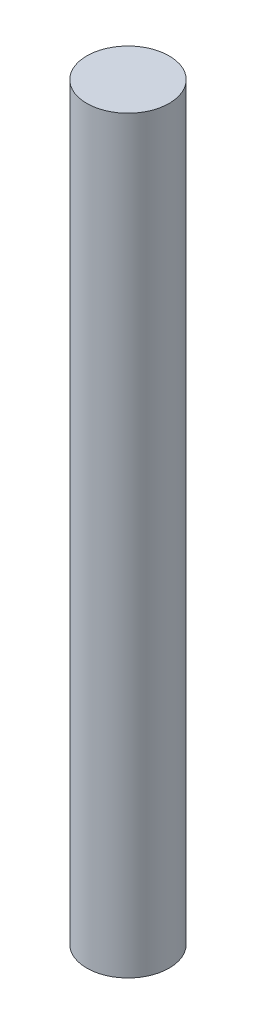
ISO-10303-21;
HEADER;
FILE_DESCRIPTION(('STEP AP214'),'2;1');
FILE_NAME('part.step','',(''),(''),'','','');
FILE_SCHEMA(('AUTOMOTIVE_DESIGN { 1 0 10303 214 1 1 1 1 }'));
ENDSEC;
DATA;
#1=APPLICATION_CONTEXT('core data for automotive mechanical design processes');
#2=APPLICATION_PROTOCOL_DEFINITION('international standard','automotive_design',2000,#1);
#3=PRODUCT_CONTEXT('',#1,'mechanical');
#4=PRODUCT('Part','Part','',(#3));
#5=PRODUCT_RELATED_PRODUCT_CATEGORY('part','',(#4));
#6=PRODUCT_DEFINITION_FORMATION('','',#4);
#7=PRODUCT_DEFINITION_CONTEXT('part definition',#1,'design');
#8=PRODUCT_DEFINITION('design','',#6,#7);
#9=PRODUCT_DEFINITION_SHAPE('','',#8);
#10=(LENGTH_UNIT() NAMED_UNIT(*) SI_UNIT(.MILLI.,.METRE.));
#11=(NAMED_UNIT(*) PLANE_ANGLE_UNIT() SI_UNIT($,.RADIAN.));
#12=(NAMED_UNIT(*) SI_UNIT($,.STERADIAN.) SOLID_ANGLE_UNIT());
#13=UNCERTAINTY_MEASURE_WITH_UNIT(LENGTH_MEASURE(1.E-05),#10,'distance_accuracy_value','');
#14=(GEOMETRIC_REPRESENTATION_CONTEXT(3) GLOBAL_UNCERTAINTY_ASSIGNED_CONTEXT((#13)) GLOBAL_UNIT_ASSIGNED_CONTEXT((#10,
#11,#12)) REPRESENTATION_CONTEXT('',''));
#15=CARTESIAN_POINT('',(0.,0.,0.));
#16=DIRECTION('',(0.,0.,1.));
#17=DIRECTION('',(1.,0.,0.));
#18=AXIS2_PLACEMENT_3D('',#15,#16,#17);
#19=CARTESIAN_POINT('',(0.,50.8,0.));
#20=DIRECTION('',(0.,-1.,0.));
#21=DIRECTION('',(0.,0.,-1.));
#22=AXIS2_PLACEMENT_3D('',#19,#20,#21);
#23=CYLINDRICAL_SURFACE('',#22,2.794);
#24=CARTESIAN_POINT('',(0.,50.8,0.));
#25=DIRECTION('',(0.,1.,0.));
#26=DIRECTION('',(0.,0.,1.));
#27=AXIS2_PLACEMENT_3D('',#24,#25,#26);
#28=CIRCLE('',#27,2.794);
#29=CARTESIAN_POINT('',(0.,50.8,2.794));
#30=VERTEX_POINT('',#29);
#31=EDGE_CURVE('E10',#30,#30,#28,.T.);
#32=ORIENTED_EDGE('',*,*,#31,.F.);
#33=EDGE_LOOP('',(#32));
#34=FACE_BOUND('',#33,.T.);
#35=CARTESIAN_POINT('',(0.,0.,0.));
#36=DIRECTION('',(0.,1.,0.));
#37=DIRECTION('',(0.,0.,1.));
#38=AXIS2_PLACEMENT_3D('',#35,#36,#37);
#39=CIRCLE('',#38,2.794);
#40=CARTESIAN_POINT('',(0.,0.,2.794));
#41=VERTEX_POINT('',#40);
#42=EDGE_CURVE('E34',#41,#41,#39,.T.);
#43=ORIENTED_EDGE('',*,*,#42,.T.);
#44=EDGE_LOOP('',(#43));
#45=FACE_BOUND('',#44,.T.);
#46=ADVANCED_FACE('F31',(#34,#45),#23,.T.);
#47=CARTESIAN_POINT('',(0.,50.8,0.));
#48=DIRECTION('',(0.,1.,0.));
#49=DIRECTION('',(0.,0.,1.));
#50=AXIS2_PLACEMENT_3D('',#47,#48,#49);
#51=PLANE('',#50);
#52=ORIENTED_EDGE('',*,*,#31,.T.);
#53=EDGE_LOOP('',(#52));
#54=FACE_BOUND('',#53,.T.);
#55=ADVANCED_FACE('F46',(#54),#51,.T.);
#56=CARTESIAN_POINT('',(0.,0.,0.));
#57=DIRECTION('',(0.,1.,0.));
#58=DIRECTION('',(0.,0.,1.));
#59=AXIS2_PLACEMENT_3D('',#56,#57,#58);
#60=PLANE('',#59);
#61=ORIENTED_EDGE('',*,*,#42,.F.);
#62=EDGE_LOOP('',(#61));
#63=FACE_BOUND('',#62,.T.);
#64=ADVANCED_FACE('F44',(#63),#60,.F.);
#65=CLOSED_SHELL('',(#46,#55,#64));
#66=MANIFOLD_SOLID_BREP('B2',#65);
#67=ADVANCED_BREP_SHAPE_REPRESENTATION('',(#18,#66),#14);
#68=SHAPE_DEFINITION_REPRESENTATION(#9,#67);
ENDSEC;
END-ISO-10303-21;
